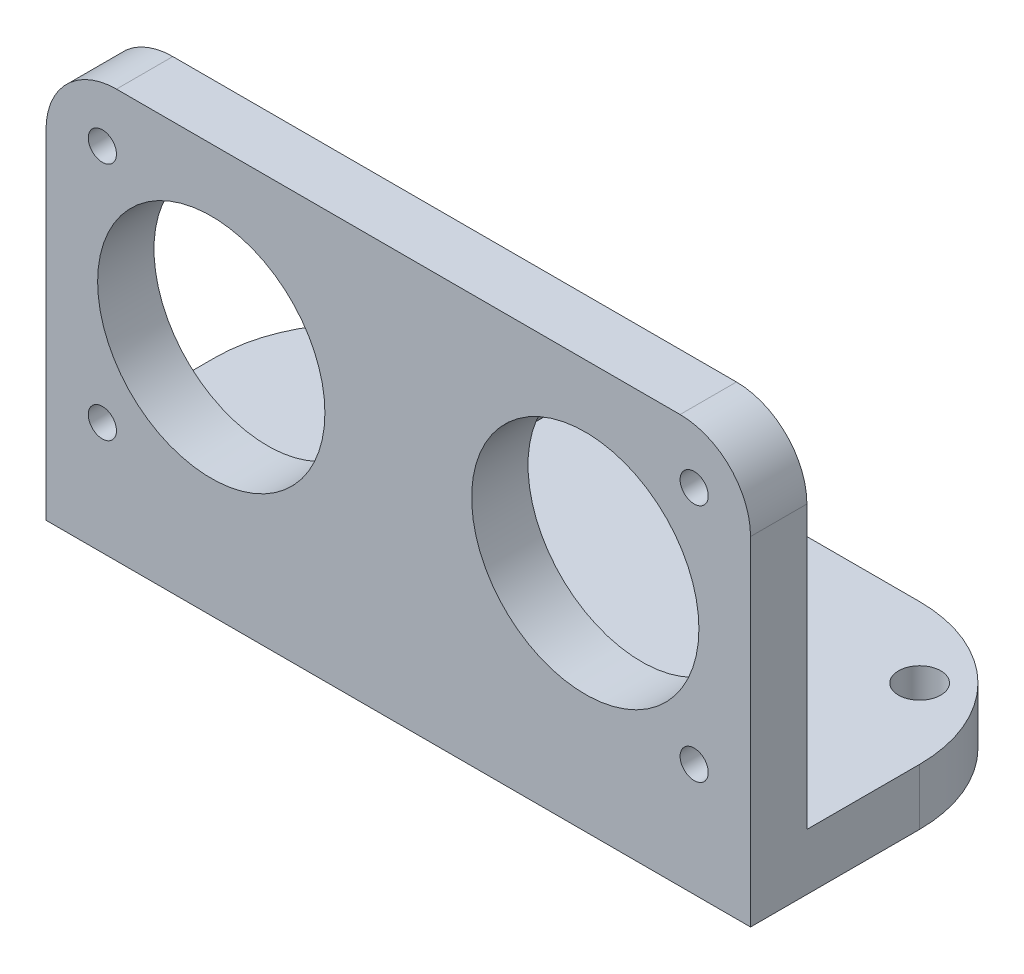
ISO-10303-21;
HEADER;
FILE_DESCRIPTION(('STEP AP214'),'2;1');
FILE_NAME('part.step','',(''),(''),'','','');
FILE_SCHEMA(('AUTOMOTIVE_DESIGN { 1 0 10303 214 1 1 1 1 }'));
ENDSEC;
DATA;
#1=APPLICATION_CONTEXT('core data for automotive mechanical design processes');
#2=APPLICATION_PROTOCOL_DEFINITION('international standard','automotive_design',2000,#1);
#3=PRODUCT_CONTEXT('',#1,'mechanical');
#4=PRODUCT('Part','Part','',(#3));
#5=PRODUCT_RELATED_PRODUCT_CATEGORY('part','',(#4));
#6=PRODUCT_DEFINITION_FORMATION('','',#4);
#7=PRODUCT_DEFINITION_CONTEXT('part definition',#1,'design');
#8=PRODUCT_DEFINITION('design','',#6,#7);
#9=PRODUCT_DEFINITION_SHAPE('','',#8);
#10=(LENGTH_UNIT() NAMED_UNIT(*) SI_UNIT(.MILLI.,.METRE.));
#11=(NAMED_UNIT(*) PLANE_ANGLE_UNIT() SI_UNIT($,.RADIAN.));
#12=(NAMED_UNIT(*) SI_UNIT($,.STERADIAN.) SOLID_ANGLE_UNIT());
#13=UNCERTAINTY_MEASURE_WITH_UNIT(LENGTH_MEASURE(1.E-05),#10,'distance_accuracy_value','');
#14=(GEOMETRIC_REPRESENTATION_CONTEXT(3) GLOBAL_UNCERTAINTY_ASSIGNED_CONTEXT((#13)) GLOBAL_UNIT_ASSIGNED_CONTEXT((#10,
#11,#12)) REPRESENTATION_CONTEXT('',''));
#15=CARTESIAN_POINT('',(0.,0.,0.));
#16=DIRECTION('',(0.,0.,1.));
#17=DIRECTION('',(1.,0.,0.));
#18=AXIS2_PLACEMENT_3D('',#15,#16,#17);
#19=CARTESIAN_POINT('',(0.,0.,0.));
#20=DIRECTION('',(0.,0.,1.));
#21=DIRECTION('',(1.,0.,0.));
#22=AXIS2_PLACEMENT_3D('',#19,#20,#21);
#23=PLANE('',#22);
#24=CARTESIAN_POINT('',(-21.,-8.5,0.));
#25=DIRECTION('',(0.,0.,-1.));
#26=DIRECTION('',(-1.,0.,0.));
#27=AXIS2_PLACEMENT_3D('',#24,#25,#26);
#28=CIRCLE('',#27,0.999999999999994);
#29=CARTESIAN_POINT('',(-22.,-8.5,0.));
#30=VERTEX_POINT('',#29);
#31=EDGE_CURVE('E289',#30,#30,#28,.T.);
#32=ORIENTED_EDGE('',*,*,#31,.F.);
#33=EDGE_LOOP('',(#32));
#34=FACE_BOUND('',#33,.T.);
#35=CARTESIAN_POINT('',(21.,-8.5,0.));
#36=DIRECTION('',(0.,0.,-1.));
#37=DIRECTION('',(-1.,0.,0.));
#38=AXIS2_PLACEMENT_3D('',#35,#36,#37);
#39=CIRCLE('',#38,0.999999999999994);
#40=CARTESIAN_POINT('',(20.,-8.5,0.));
#41=VERTEX_POINT('',#40);
#42=EDGE_CURVE('E283',#41,#41,#39,.T.);
#43=ORIENTED_EDGE('',*,*,#42,.F.);
#44=EDGE_LOOP('',(#43));
#45=FACE_BOUND('',#44,.T.);
#46=CARTESIAN_POINT('',(21.,8.5,0.));
#47=DIRECTION('',(0.,0.,-1.));
#48=DIRECTION('',(-1.,0.,0.));
#49=AXIS2_PLACEMENT_3D('',#46,#47,#48);
#50=CIRCLE('',#49,0.999999999999994);
#51=CARTESIAN_POINT('',(20.,8.5,0.));
#52=VERTEX_POINT('',#51);
#53=EDGE_CURVE('E277',#52,#52,#50,.T.);
#54=ORIENTED_EDGE('',*,*,#53,.F.);
#55=EDGE_LOOP('',(#54));
#56=FACE_BOUND('',#55,.T.);
#57=CARTESIAN_POINT('',(0.,0.,0.));
#58=DIRECTION('',(0.,0.,1.));
#59=DIRECTION('',(1.,0.,0.));
#60=AXIS2_PLACEMENT_3D('',#57,#58,#59);
#61=CIRCLE('',#60,2.);
#62=CARTESIAN_POINT('',(2.,0.,0.));
#63=VERTEX_POINT('',#62);
#64=EDGE_CURVE('E151',#63,#63,#61,.F.);
#65=ORIENTED_EDGE('',*,*,#64,.F.);
#66=EDGE_LOOP('',(#65));
#67=FACE_BOUND('',#66,.T.);
#68=CARTESIAN_POINT('',(-13.2715,0.,0.));
#69=DIRECTION('',(0.,0.,1.));
#70=DIRECTION('',(1.,0.,0.));
#71=AXIS2_PLACEMENT_3D('',#68,#69,#70);
#72=CIRCLE('',#71,8.0645);
#73=CARTESIAN_POINT('',(-5.207,0.,0.));
#74=VERTEX_POINT('',#73);
#75=EDGE_CURVE('E162',#74,#74,#72,.F.);
#76=ORIENTED_EDGE('',*,*,#75,.F.);
#77=EDGE_LOOP('',(#76));
#78=FACE_BOUND('',#77,.T.);
#79=CARTESIAN_POINT('',(13.2715,0.,0.));
#80=DIRECTION('',(0.,0.,1.));
#81=DIRECTION('',(1.,0.,0.));
#82=AXIS2_PLACEMENT_3D('',#79,#80,#81);
#83=CIRCLE('',#82,8.0645);
#84=CARTESIAN_POINT('',(21.336,0.,0.));
#85=VERTEX_POINT('',#84);
#86=EDGE_CURVE('E144',#85,#85,#83,.T.);
#87=ORIENTED_EDGE('',*,*,#86,.T.);
#88=EDGE_LOOP('',(#87));
#89=FACE_BOUND('',#88,.T.);
#90=DIRECTION('',(-1.,0.,0.));
#91=VECTOR('',#90,1.);
#92=CARTESIAN_POINT('',(-25.,12.5,0.));
#93=LINE('',#92,#91);
#94=CARTESIAN_POINT('',(20.,12.5,0.));
#95=VERTEX_POINT('',#94);
#96=CARTESIAN_POINT('',(-20.,12.5,0.));
#97=VERTEX_POINT('',#96);
#98=EDGE_CURVE('E136',#95,#97,#93,.T.);
#99=ORIENTED_EDGE('',*,*,#98,.F.);
#100=CARTESIAN_POINT('',(20.,7.5,0.));
#101=DIRECTION('',(0.,0.,1.));
#102=DIRECTION('',(1.,0.,0.));
#103=AXIS2_PLACEMENT_3D('',#100,#101,#102);
#104=CIRCLE('',#103,5.);
#105=CARTESIAN_POINT('',(25.,7.5,0.));
#106=VERTEX_POINT('',#105);
#107=EDGE_CURVE('E191',#95,#106,#104,.F.);
#108=ORIENTED_EDGE('',*,*,#107,.T.);
#109=DIRECTION('',(0.,1.,0.));
#110=VECTOR('',#109,1.);
#111=CARTESIAN_POINT('',(25.,12.5,0.));
#112=LINE('',#111,#110);
#113=CARTESIAN_POINT('',(25.,-12.5,0.));
#114=VERTEX_POINT('',#113);
#115=EDGE_CURVE('E134',#114,#106,#112,.T.);
#116=ORIENTED_EDGE('',*,*,#115,.F.);
#117=DIRECTION('',(1.,0.,0.));
#118=VECTOR('',#117,1.);
#119=CARTESIAN_POINT('',(-25.,-12.5,0.));
#120=LINE('',#119,#118);
#121=CARTESIAN_POINT('',(-25.,-12.5,0.));
#122=VERTEX_POINT('',#121);
#123=EDGE_CURVE('E130',#122,#114,#120,.T.);
#124=ORIENTED_EDGE('',*,*,#123,.F.);
#125=DIRECTION('',(0.,-1.,0.));
#126=VECTOR('',#125,1.);
#127=CARTESIAN_POINT('',(-25.,12.5,0.));
#128=LINE('',#127,#126);
#129=CARTESIAN_POINT('',(-25.,7.5,0.));
#130=VERTEX_POINT('',#129);
#131=EDGE_CURVE('E155',#130,#122,#128,.T.);
#132=ORIENTED_EDGE('',*,*,#131,.F.);
#133=CARTESIAN_POINT('',(-20.,7.5,0.));
#134=DIRECTION('',(0.,0.,1.));
#135=DIRECTION('',(1.,0.,0.));
#136=AXIS2_PLACEMENT_3D('',#133,#134,#135);
#137=CIRCLE('',#136,5.);
#138=EDGE_CURVE('E189',#130,#97,#137,.F.);
#139=ORIENTED_EDGE('',*,*,#138,.T.);
#140=EDGE_LOOP('',(#99,#108,#116,#124,#132,#139));
#141=FACE_BOUND('',#140,.T.);
#142=CARTESIAN_POINT('',(-21.,8.5,0.));
#143=DIRECTION('',(0.,0.,-1.));
#144=DIRECTION('',(-1.,0.,0.));
#145=AXIS2_PLACEMENT_3D('',#142,#143,#144);
#146=CIRCLE('',#145,0.999999999999994);
#147=CARTESIAN_POINT('',(-22.,8.5,0.));
#148=VERTEX_POINT('',#147);
#149=EDGE_CURVE('E295',#148,#148,#146,.T.);
#150=ORIENTED_EDGE('',*,*,#149,.F.);
#151=EDGE_LOOP('',(#150));
#152=FACE_BOUND('',#151,.T.);
#153=ADVANCED_FACE('F33',(#34,#45,#56,#67,#78,#89,#141,#152),#23,.F.);
#154=CARTESIAN_POINT('',(25.,12.5,4.));
#155=DIRECTION('',(-1.,0.,0.));
#156=DIRECTION('',(0.,-1.,0.));
#157=AXIS2_PLACEMENT_3D('',#154,#155,#156);
#158=PLANE('',#157);
#159=ORIENTED_EDGE('',*,*,#115,.T.);
#160=DIRECTION('',(0.,0.,-1.));
#161=VECTOR('',#160,1.);
#162=CARTESIAN_POINT('',(25.,7.5,4.));
#163=LINE('',#162,#161);
#164=CARTESIAN_POINT('',(25.,7.5,4.));
#165=VERTEX_POINT('',#164);
#166=EDGE_CURVE('E56',#106,#165,#163,.F.);
#167=ORIENTED_EDGE('',*,*,#166,.T.);
#168=DIRECTION('',(0.,1.,0.));
#169=VECTOR('',#168,1.);
#170=CARTESIAN_POINT('',(25.,12.5,4.));
#171=LINE('',#170,#169);
#172=CARTESIAN_POINT('',(25.,-16.5,4.));
#173=VERTEX_POINT('',#172);
#174=EDGE_CURVE('E126',#173,#165,#171,.T.);
#175=ORIENTED_EDGE('',*,*,#174,.F.);
#176=DIRECTION('',(0.,0.,1.));
#177=VECTOR('',#176,1.);
#178=CARTESIAN_POINT('',(25.,-16.5,-18.));
#179=LINE('',#178,#177);
#180=CARTESIAN_POINT('',(25.,-16.5,-7.99999999999999));
#181=VERTEX_POINT('',#180);
#182=EDGE_CURVE('E113',#181,#173,#179,.T.);
#183=ORIENTED_EDGE('',*,*,#182,.F.);
#184=DIRECTION('',(0.,1.,0.));
#185=VECTOR('',#184,1.);
#186=CARTESIAN_POINT('',(25.,12.5,-7.99999999999999));
#187=LINE('',#186,#185);
#188=CARTESIAN_POINT('',(25.,-12.5,-7.99999999999999));
#189=VERTEX_POINT('',#188);
#190=EDGE_CURVE('E168',#181,#189,#187,.T.);
#191=ORIENTED_EDGE('',*,*,#190,.T.);
#192=DIRECTION('',(0.,0.,1.));
#193=VECTOR('',#192,1.);
#194=CARTESIAN_POINT('',(25.,-12.5,-18.));
#195=LINE('',#194,#193);
#196=EDGE_CURVE('E147',#189,#114,#195,.T.);
#197=ORIENTED_EDGE('',*,*,#196,.T.);
#198=EDGE_LOOP('',(#159,#167,#175,#183,#191,#197));
#199=FACE_BOUND('',#198,.T.);
#200=ADVANCED_FACE('F127',(#199),#158,.F.);
#201=CARTESIAN_POINT('',(-25.,12.5,4.));
#202=DIRECTION('',(0.,-1.,0.));
#203=DIRECTION('',(0.,0.,-1.));
#204=AXIS2_PLACEMENT_3D('',#201,#202,#203);
#205=PLANE('',#204);
#206=DIRECTION('',(-1.,0.,0.));
#207=VECTOR('',#206,1.);
#208=CARTESIAN_POINT('',(-25.,12.5,4.));
#209=LINE('',#208,#207);
#210=CARTESIAN_POINT('',(20.,12.5,4.));
#211=VERTEX_POINT('',#210);
#212=CARTESIAN_POINT('',(-20.,12.5,4.));
#213=VERTEX_POINT('',#212);
#214=EDGE_CURVE('E129',#211,#213,#209,.T.);
#215=ORIENTED_EDGE('',*,*,#214,.F.);
#216=DIRECTION('',(0.,0.,-1.));
#217=VECTOR('',#216,1.);
#218=CARTESIAN_POINT('',(20.,12.5,4.));
#219=LINE('',#218,#217);
#220=EDGE_CURVE('E186',#211,#95,#219,.T.);
#221=ORIENTED_EDGE('',*,*,#220,.T.);
#222=ORIENTED_EDGE('',*,*,#98,.T.);
#223=DIRECTION('',(0.,0.,-1.));
#224=VECTOR('',#223,1.);
#225=CARTESIAN_POINT('',(-20.,12.5,4.));
#226=LINE('',#225,#224);
#227=EDGE_CURVE('E184',#97,#213,#226,.F.);
#228=ORIENTED_EDGE('',*,*,#227,.T.);
#229=EDGE_LOOP('',(#215,#221,#222,#228));
#230=FACE_BOUND('',#229,.T.);
#231=ADVANCED_FACE('F198',(#230),#205,.F.);
#232=CARTESIAN_POINT('',(-25.,12.5,4.));
#233=DIRECTION('',(1.,0.,0.));
#234=DIRECTION('',(0.,1.,0.));
#235=AXIS2_PLACEMENT_3D('',#232,#233,#234);
#236=PLANE('',#235);
#237=DIRECTION('',(0.,-1.,0.));
#238=VECTOR('',#237,1.);
#239=CARTESIAN_POINT('',(-25.,12.5,4.));
#240=LINE('',#239,#238);
#241=CARTESIAN_POINT('',(-25.,7.5,4.));
#242=VERTEX_POINT('',#241);
#243=CARTESIAN_POINT('',(-25.,-16.5,4.));
#244=VERTEX_POINT('',#243);
#245=EDGE_CURVE('E133',#242,#244,#240,.T.);
#246=ORIENTED_EDGE('',*,*,#245,.F.);
#247=DIRECTION('',(0.,0.,-1.));
#248=VECTOR('',#247,1.);
#249=CARTESIAN_POINT('',(-25.,7.5,4.));
#250=LINE('',#249,#248);
#251=EDGE_CURVE('E11',#242,#130,#250,.T.);
#252=ORIENTED_EDGE('',*,*,#251,.T.);
#253=ORIENTED_EDGE('',*,*,#131,.T.);
#254=DIRECTION('',(0.,0.,-1.));
#255=VECTOR('',#254,1.);
#256=CARTESIAN_POINT('',(-25.,-12.5,-18.));
#257=LINE('',#256,#255);
#258=CARTESIAN_POINT('',(-25.,-12.5,-8.));
#259=VERTEX_POINT('',#258);
#260=EDGE_CURVE('E140',#122,#259,#257,.T.);
#261=ORIENTED_EDGE('',*,*,#260,.T.);
#262=DIRECTION('',(0.,1.,0.));
#263=VECTOR('',#262,1.);
#264=CARTESIAN_POINT('',(-25.,12.5,-8.));
#265=LINE('',#264,#263);
#266=CARTESIAN_POINT('',(-25.,-16.5,-8.));
#267=VERTEX_POINT('',#266);
#268=EDGE_CURVE('E182',#259,#267,#265,.F.);
#269=ORIENTED_EDGE('',*,*,#268,.T.);
#270=DIRECTION('',(0.,0.,-1.));
#271=VECTOR('',#270,1.);
#272=CARTESIAN_POINT('',(-25.,-16.5,-18.));
#273=LINE('',#272,#271);
#274=EDGE_CURVE('E148',#244,#267,#273,.T.);
#275=ORIENTED_EDGE('',*,*,#274,.F.);
#276=EDGE_LOOP('',(#246,#252,#253,#261,#269,#275));
#277=FACE_BOUND('',#276,.T.);
#278=ADVANCED_FACE('F213',(#277),#236,.F.);
#279=CARTESIAN_POINT('',(0.,0.,4.));
#280=DIRECTION('',(0.,0.,1.));
#281=DIRECTION('',(1.,0.,0.));
#282=AXIS2_PLACEMENT_3D('',#279,#280,#281);
#283=PLANE('',#282);
#284=CARTESIAN_POINT('',(-21.,8.5,4.));
#285=DIRECTION('',(0.,0.,-1.));
#286=DIRECTION('',(-1.,0.,0.));
#287=AXIS2_PLACEMENT_3D('',#284,#285,#286);
#288=CIRCLE('',#287,0.999999999999994);
#289=CARTESIAN_POINT('',(-22.,8.5,4.));
#290=VERTEX_POINT('',#289);
#291=EDGE_CURVE('E292',#290,#290,#288,.T.);
#292=ORIENTED_EDGE('',*,*,#291,.T.);
#293=EDGE_LOOP('',(#292));
#294=FACE_BOUND('',#293,.T.);
#295=CARTESIAN_POINT('',(-21.,-8.5,4.));
#296=DIRECTION('',(0.,0.,-1.));
#297=DIRECTION('',(-1.,0.,0.));
#298=AXIS2_PLACEMENT_3D('',#295,#296,#297);
#299=CIRCLE('',#298,0.999999999999994);
#300=CARTESIAN_POINT('',(-22.,-8.5,4.));
#301=VERTEX_POINT('',#300);
#302=EDGE_CURVE('E286',#301,#301,#299,.T.);
#303=ORIENTED_EDGE('',*,*,#302,.T.);
#304=EDGE_LOOP('',(#303));
#305=FACE_BOUND('',#304,.T.);
#306=CARTESIAN_POINT('',(21.,-8.5,4.));
#307=DIRECTION('',(0.,0.,-1.));
#308=DIRECTION('',(-1.,0.,0.));
#309=AXIS2_PLACEMENT_3D('',#306,#307,#308);
#310=CIRCLE('',#309,0.999999999999994);
#311=CARTESIAN_POINT('',(20.,-8.5,4.));
#312=VERTEX_POINT('',#311);
#313=EDGE_CURVE('E280',#312,#312,#310,.T.);
#314=ORIENTED_EDGE('',*,*,#313,.T.);
#315=EDGE_LOOP('',(#314));
#316=FACE_BOUND('',#315,.T.);
#317=CARTESIAN_POINT('',(21.,8.5,4.));
#318=DIRECTION('',(0.,0.,-1.));
#319=DIRECTION('',(-1.,0.,0.));
#320=AXIS2_PLACEMENT_3D('',#317,#318,#319);
#321=CIRCLE('',#320,0.999999999999994);
#322=CARTESIAN_POINT('',(20.,8.5,4.));
#323=VERTEX_POINT('',#322);
#324=EDGE_CURVE('E274',#323,#323,#321,.T.);
#325=ORIENTED_EDGE('',*,*,#324,.T.);
#326=EDGE_LOOP('',(#325));
#327=FACE_BOUND('',#326,.T.);
#328=CARTESIAN_POINT('',(-13.2715,0.,4.));
#329=DIRECTION('',(0.,0.,-1.));
#330=DIRECTION('',(-1.,0.,0.));
#331=AXIS2_PLACEMENT_3D('',#328,#329,#330);
#332=CIRCLE('',#331,8.0645);
#333=CARTESIAN_POINT('',(-21.336,0.,4.));
#334=VERTEX_POINT('',#333);
#335=EDGE_CURVE('E165',#334,#334,#332,.T.);
#336=ORIENTED_EDGE('',*,*,#335,.T.);
#337=EDGE_LOOP('',(#336));
#338=FACE_BOUND('',#337,.T.);
#339=CARTESIAN_POINT('',(13.2715,0.,4.));
#340=DIRECTION('',(0.,0.,1.));
#341=DIRECTION('',(1.,0.,0.));
#342=AXIS2_PLACEMENT_3D('',#339,#340,#341);
#343=CIRCLE('',#342,8.0645);
#344=CARTESIAN_POINT('',(21.336,0.,4.));
#345=VERTEX_POINT('',#344);
#346=EDGE_CURVE('E161',#345,#345,#343,.T.);
#347=ORIENTED_EDGE('',*,*,#346,.F.);
#348=EDGE_LOOP('',(#347));
#349=FACE_BOUND('',#348,.T.);
#350=ORIENTED_EDGE('',*,*,#174,.T.);
#351=CARTESIAN_POINT('',(20.,7.5,4.));
#352=DIRECTION('',(0.,0.,1.));
#353=DIRECTION('',(1.,0.,0.));
#354=AXIS2_PLACEMENT_3D('',#351,#352,#353);
#355=CIRCLE('',#354,5.);
#356=EDGE_CURVE('E41',#165,#211,#355,.T.);
#357=ORIENTED_EDGE('',*,*,#356,.T.);
#358=ORIENTED_EDGE('',*,*,#214,.T.);
#359=CARTESIAN_POINT('',(-20.,7.5,4.));
#360=DIRECTION('',(0.,0.,1.));
#361=DIRECTION('',(1.,0.,0.));
#362=AXIS2_PLACEMENT_3D('',#359,#360,#361);
#363=CIRCLE('',#362,5.);
#364=EDGE_CURVE('E48',#213,#242,#363,.T.);
#365=ORIENTED_EDGE('',*,*,#364,.T.);
#366=ORIENTED_EDGE('',*,*,#245,.T.);
#367=DIRECTION('',(-1.,0.,0.));
#368=VECTOR('',#367,1.);
#369=CARTESIAN_POINT('',(25.,-16.5,4.));
#370=LINE('',#369,#368);
#371=EDGE_CURVE('E118',#173,#244,#370,.T.);
#372=ORIENTED_EDGE('',*,*,#371,.F.);
#373=EDGE_LOOP('',(#350,#357,#358,#365,#366,#372));
#374=FACE_BOUND('',#373,.T.);
#375=ADVANCED_FACE('F132',(#294,#305,#316,#327,#338,#349,#374),#283,.T.);
#376=CARTESIAN_POINT('',(0.,-12.5,0.));
#377=DIRECTION('',(0.,-1.,0.));
#378=DIRECTION('',(0.,0.,-1.));
#379=AXIS2_PLACEMENT_3D('',#376,#377,#378);
#380=PLANE('',#379);
#381=CARTESIAN_POINT('',(20.,-12.5,-13.));
#382=DIRECTION('',(0.,1.,0.));
#383=DIRECTION('',(0.,0.,1.));
#384=AXIS2_PLACEMENT_3D('',#381,#382,#383);
#385=CIRCLE('',#384,1.49999999999999);
#386=CARTESIAN_POINT('',(20.,-12.5,-11.5));
#387=VERTEX_POINT('',#386);
#388=EDGE_CURVE('E271',#387,#387,#385,.T.);
#389=ORIENTED_EDGE('',*,*,#388,.F.);
#390=EDGE_LOOP('',(#389));
#391=FACE_BOUND('',#390,.T.);
#392=CARTESIAN_POINT('',(-20.,-12.5,-13.));
#393=DIRECTION('',(0.,1.,0.));
#394=DIRECTION('',(0.,0.,1.));
#395=AXIS2_PLACEMENT_3D('',#392,#393,#394);
#396=CIRCLE('',#395,1.49999999999999);
#397=CARTESIAN_POINT('',(-20.,-12.5,-11.5));
#398=VERTEX_POINT('',#397);
#399=EDGE_CURVE('E265',#398,#398,#396,.T.);
#400=ORIENTED_EDGE('',*,*,#399,.F.);
#401=EDGE_LOOP('',(#400));
#402=FACE_BOUND('',#401,.T.);
#403=ORIENTED_EDGE('',*,*,#196,.F.);
#404=CARTESIAN_POINT('',(15.,-12.5,-7.99999999999999));
#405=DIRECTION('',(0.,-1.,0.));
#406=DIRECTION('',(0.,0.,-1.));
#407=AXIS2_PLACEMENT_3D('',#404,#405,#406);
#408=CIRCLE('',#407,10.);
#409=CARTESIAN_POINT('',(15.,-12.5,-18.));
#410=VERTEX_POINT('',#409);
#411=EDGE_CURVE('E172',#189,#410,#408,.F.);
#412=ORIENTED_EDGE('',*,*,#411,.T.);
#413=DIRECTION('',(1.,0.,0.));
#414=VECTOR('',#413,1.);
#415=CARTESIAN_POINT('',(25.,-12.5,-18.));
#416=LINE('',#415,#414);
#417=CARTESIAN_POINT('',(-15.,-12.5,-18.));
#418=VERTEX_POINT('',#417);
#419=EDGE_CURVE('E143',#418,#410,#416,.T.);
#420=ORIENTED_EDGE('',*,*,#419,.F.);
#421=CARTESIAN_POINT('',(-15.,-12.5,-8.));
#422=DIRECTION('',(0.,-1.,0.));
#423=DIRECTION('',(0.,0.,-1.));
#424=AXIS2_PLACEMENT_3D('',#421,#422,#423);
#425=CIRCLE('',#424,10.);
#426=EDGE_CURVE('E170',#418,#259,#425,.F.);
#427=ORIENTED_EDGE('',*,*,#426,.T.);
#428=ORIENTED_EDGE('',*,*,#260,.F.);
#429=ORIENTED_EDGE('',*,*,#123,.T.);
#430=EDGE_LOOP('',(#403,#412,#420,#427,#428,#429));
#431=FACE_BOUND('',#430,.T.);
#432=ADVANCED_FACE('F208',(#391,#402,#431),#380,.F.);
#433=CARTESIAN_POINT('',(25.,-16.5,-18.));
#434=DIRECTION('',(0.,0.,1.));
#435=DIRECTION('',(1.,0.,0.));
#436=AXIS2_PLACEMENT_3D('',#433,#434,#435);
#437=PLANE('',#436);
#438=ORIENTED_EDGE('',*,*,#419,.T.);
#439=DIRECTION('',(0.,1.,0.));
#440=VECTOR('',#439,1.);
#441=CARTESIAN_POINT('',(15.,-16.5,-18.));
#442=LINE('',#441,#440);
#443=CARTESIAN_POINT('',(15.,-16.5,-18.));
#444=VERTEX_POINT('',#443);
#445=EDGE_CURVE('E177',#410,#444,#442,.F.);
#446=ORIENTED_EDGE('',*,*,#445,.T.);
#447=DIRECTION('',(1.,0.,0.));
#448=VECTOR('',#447,1.);
#449=CARTESIAN_POINT('',(25.,-16.5,-18.));
#450=LINE('',#449,#448);
#451=CARTESIAN_POINT('',(-15.,-16.5,-18.));
#452=VERTEX_POINT('',#451);
#453=EDGE_CURVE('E124',#452,#444,#450,.T.);
#454=ORIENTED_EDGE('',*,*,#453,.F.);
#455=DIRECTION('',(0.,1.,0.));
#456=VECTOR('',#455,1.);
#457=CARTESIAN_POINT('',(-15.,-16.5,-18.));
#458=LINE('',#457,#456);
#459=EDGE_CURVE('E174',#452,#418,#458,.T.);
#460=ORIENTED_EDGE('',*,*,#459,.T.);
#461=EDGE_LOOP('',(#438,#446,#454,#460));
#462=FACE_BOUND('',#461,.T.);
#463=ADVANCED_FACE('F251',(#462),#437,.F.);
#464=CARTESIAN_POINT('',(0.,-16.5,0.));
#465=DIRECTION('',(0.,-1.,0.));
#466=DIRECTION('',(0.,0.,-1.));
#467=AXIS2_PLACEMENT_3D('',#464,#465,#466);
#468=PLANE('',#467);
#469=CARTESIAN_POINT('',(20.,-16.5,-13.));
#470=DIRECTION('',(0.,1.,0.));
#471=DIRECTION('',(0.,0.,1.));
#472=AXIS2_PLACEMENT_3D('',#469,#470,#471);
#473=CIRCLE('',#472,1.49999999999999);
#474=CARTESIAN_POINT('',(20.,-16.5,-11.5));
#475=VERTEX_POINT('',#474);
#476=EDGE_CURVE('E268',#475,#475,#473,.T.);
#477=ORIENTED_EDGE('',*,*,#476,.T.);
#478=EDGE_LOOP('',(#477));
#479=FACE_BOUND('',#478,.T.);
#480=CARTESIAN_POINT('',(-20.,-16.5,-13.));
#481=DIRECTION('',(0.,1.,0.));
#482=DIRECTION('',(0.,0.,1.));
#483=AXIS2_PLACEMENT_3D('',#480,#481,#482);
#484=CIRCLE('',#483,1.49999999999999);
#485=CARTESIAN_POINT('',(-20.,-16.5,-11.5));
#486=VERTEX_POINT('',#485);
#487=EDGE_CURVE('E262',#486,#486,#484,.T.);
#488=ORIENTED_EDGE('',*,*,#487,.T.);
#489=EDGE_LOOP('',(#488));
#490=FACE_BOUND('',#489,.T.);
#491=ORIENTED_EDGE('',*,*,#453,.T.);
#492=CARTESIAN_POINT('',(15.,-16.5,-7.99999999999999));
#493=DIRECTION('',(0.,-1.,0.));
#494=DIRECTION('',(0.,0.,-1.));
#495=AXIS2_PLACEMENT_3D('',#492,#493,#494);
#496=CIRCLE('',#495,10.);
#497=EDGE_CURVE('E121',#444,#181,#496,.T.);
#498=ORIENTED_EDGE('',*,*,#497,.T.);
#499=ORIENTED_EDGE('',*,*,#182,.T.);
#500=ORIENTED_EDGE('',*,*,#371,.T.);
#501=ORIENTED_EDGE('',*,*,#274,.T.);
#502=CARTESIAN_POINT('',(-15.,-16.5,-8.));
#503=DIRECTION('',(0.,-1.,0.));
#504=DIRECTION('',(0.,0.,-1.));
#505=AXIS2_PLACEMENT_3D('',#502,#503,#504);
#506=CIRCLE('',#505,10.);
#507=EDGE_CURVE('E179',#267,#452,#506,.T.);
#508=ORIENTED_EDGE('',*,*,#507,.T.);
#509=EDGE_LOOP('',(#491,#498,#499,#500,#501,#508));
#510=FACE_BOUND('',#509,.T.);
#511=ADVANCED_FACE('F115',(#479,#490,#510),#468,.T.);
#512=CARTESIAN_POINT('',(13.2715,0.,-18.));
#513=DIRECTION('',(0.,0.,1.));
#514=DIRECTION('',(1.,0.,0.));
#515=AXIS2_PLACEMENT_3D('',#512,#513,#514);
#516=CYLINDRICAL_SURFACE('',#515,8.0645);
#517=ORIENTED_EDGE('',*,*,#346,.T.);
#518=EDGE_LOOP('',(#517));
#519=FACE_BOUND('',#518,.T.);
#520=ORIENTED_EDGE('',*,*,#86,.F.);
#521=EDGE_LOOP('',(#520));
#522=FACE_BOUND('',#521,.T.);
#523=ADVANCED_FACE('F337',(#519,#522),#516,.F.);
#524=CARTESIAN_POINT('',(-13.2715,0.,-18.));
#525=DIRECTION('',(0.,0.,1.));
#526=DIRECTION('',(1.,0.,0.));
#527=AXIS2_PLACEMENT_3D('',#524,#525,#526);
#528=CYLINDRICAL_SURFACE('',#527,8.0645);
#529=ORIENTED_EDGE('',*,*,#335,.F.);
#530=EDGE_LOOP('',(#529));
#531=FACE_BOUND('',#530,.T.);
#532=ORIENTED_EDGE('',*,*,#75,.T.);
#533=EDGE_LOOP('',(#532));
#534=FACE_BOUND('',#533,.T.);
#535=ADVANCED_FACE('F333',(#531,#534),#528,.F.);
#536=CARTESIAN_POINT('',(0.,0.,-5.));
#537=DIRECTION('',(0.,0.,1.));
#538=DIRECTION('',(1.,0.,0.));
#539=AXIS2_PLACEMENT_3D('',#536,#537,#538);
#540=CYLINDRICAL_SURFACE('',#539,2.);
#541=CARTESIAN_POINT('',(0.,0.,-5.));
#542=DIRECTION('',(0.,0.,-1.));
#543=DIRECTION('',(-1.,0.,0.));
#544=AXIS2_PLACEMENT_3D('',#541,#542,#543);
#545=CIRCLE('',#544,2.);
#546=CARTESIAN_POINT('',(-2.,0.,-5.));
#547=VERTEX_POINT('',#546);
#548=EDGE_CURVE('E259',#547,#547,#545,.T.);
#549=ORIENTED_EDGE('',*,*,#548,.F.);
#550=EDGE_LOOP('',(#549));
#551=FACE_BOUND('',#550,.T.);
#552=ORIENTED_EDGE('',*,*,#64,.T.);
#553=EDGE_LOOP('',(#552));
#554=FACE_BOUND('',#553,.T.);
#555=ADVANCED_FACE('F329',(#551,#554),#540,.T.);
#556=CARTESIAN_POINT('',(0.,0.,-5.));
#557=DIRECTION('',(0.,0.,-1.));
#558=DIRECTION('',(-1.,0.,0.));
#559=AXIS2_PLACEMENT_3D('',#556,#557,#558);
#560=PLANE('',#559);
#561=ORIENTED_EDGE('',*,*,#548,.T.);
#562=EDGE_LOOP('',(#561));
#563=FACE_BOUND('',#562,.T.);
#564=ADVANCED_FACE('F325',(#563),#560,.T.);
#565=CARTESIAN_POINT('',(-20.,-12.5,-13.));
#566=DIRECTION('',(0.,1.,0.));
#567=DIRECTION('',(0.,0.,1.));
#568=AXIS2_PLACEMENT_3D('',#565,#566,#567);
#569=CYLINDRICAL_SURFACE('',#568,1.49999999999999);
#570=ORIENTED_EDGE('',*,*,#487,.F.);
#571=EDGE_LOOP('',(#570));
#572=FACE_BOUND('',#571,.T.);
#573=ORIENTED_EDGE('',*,*,#399,.T.);
#574=EDGE_LOOP('',(#573));
#575=FACE_BOUND('',#574,.T.);
#576=ADVANCED_FACE('F321',(#572,#575),#569,.F.);
#577=CARTESIAN_POINT('',(20.,-12.5,-13.));
#578=DIRECTION('',(0.,1.,0.));
#579=DIRECTION('',(0.,0.,1.));
#580=AXIS2_PLACEMENT_3D('',#577,#578,#579);
#581=CYLINDRICAL_SURFACE('',#580,1.49999999999999);
#582=ORIENTED_EDGE('',*,*,#476,.F.);
#583=EDGE_LOOP('',(#582));
#584=FACE_BOUND('',#583,.T.);
#585=ORIENTED_EDGE('',*,*,#388,.T.);
#586=EDGE_LOOP('',(#585));
#587=FACE_BOUND('',#586,.T.);
#588=ADVANCED_FACE('F317',(#584,#587),#581,.F.);
#589=CARTESIAN_POINT('',(21.,8.5,0.));
#590=DIRECTION('',(0.,0.,-1.));
#591=DIRECTION('',(-1.,0.,0.));
#592=AXIS2_PLACEMENT_3D('',#589,#590,#591);
#593=CYLINDRICAL_SURFACE('',#592,0.999999999999994);
#594=ORIENTED_EDGE('',*,*,#324,.F.);
#595=EDGE_LOOP('',(#594));
#596=FACE_BOUND('',#595,.T.);
#597=ORIENTED_EDGE('',*,*,#53,.T.);
#598=EDGE_LOOP('',(#597));
#599=FACE_BOUND('',#598,.T.);
#600=ADVANCED_FACE('F313',(#596,#599),#593,.F.);
#601=CARTESIAN_POINT('',(21.,-8.5,0.));
#602=DIRECTION('',(0.,0.,-1.));
#603=DIRECTION('',(-1.,0.,0.));
#604=AXIS2_PLACEMENT_3D('',#601,#602,#603);
#605=CYLINDRICAL_SURFACE('',#604,0.999999999999994);
#606=ORIENTED_EDGE('',*,*,#313,.F.);
#607=EDGE_LOOP('',(#606));
#608=FACE_BOUND('',#607,.T.);
#609=ORIENTED_EDGE('',*,*,#42,.T.);
#610=EDGE_LOOP('',(#609));
#611=FACE_BOUND('',#610,.T.);
#612=ADVANCED_FACE('F306',(#608,#611),#605,.F.);
#613=CARTESIAN_POINT('',(-21.,-8.5,0.));
#614=DIRECTION('',(0.,0.,-1.));
#615=DIRECTION('',(-1.,0.,0.));
#616=AXIS2_PLACEMENT_3D('',#613,#614,#615);
#617=CYLINDRICAL_SURFACE('',#616,0.999999999999994);
#618=ORIENTED_EDGE('',*,*,#302,.F.);
#619=EDGE_LOOP('',(#618));
#620=FACE_BOUND('',#619,.T.);
#621=ORIENTED_EDGE('',*,*,#31,.T.);
#622=EDGE_LOOP('',(#621));
#623=FACE_BOUND('',#622,.T.);
#624=ADVANCED_FACE('F300',(#620,#623),#617,.F.);
#625=CARTESIAN_POINT('',(-21.,8.5,0.));
#626=DIRECTION('',(0.,0.,-1.));
#627=DIRECTION('',(-1.,0.,0.));
#628=AXIS2_PLACEMENT_3D('',#625,#626,#627);
#629=CYLINDRICAL_SURFACE('',#628,0.999999999999994);
#630=ORIENTED_EDGE('',*,*,#291,.F.);
#631=EDGE_LOOP('',(#630));
#632=FACE_BOUND('',#631,.T.);
#633=ORIENTED_EDGE('',*,*,#149,.T.);
#634=EDGE_LOOP('',(#633));
#635=FACE_BOUND('',#634,.T.);
#636=ADVANCED_FACE('F241',(#632,#635),#629,.F.);
#637=CARTESIAN_POINT('',(15.,12.5,-7.99999999999999));
#638=DIRECTION('',(0.,1.,0.));
#639=DIRECTION('',(-1.,0.,0.));
#640=AXIS2_PLACEMENT_3D('',#637,#638,#639);
#641=CYLINDRICAL_SURFACE('',#640,10.);
#642=ORIENTED_EDGE('',*,*,#497,.F.);
#643=ORIENTED_EDGE('',*,*,#445,.F.);
#644=ORIENTED_EDGE('',*,*,#411,.F.);
#645=ORIENTED_EDGE('',*,*,#190,.F.);
#646=EDGE_LOOP('',(#642,#643,#644,#645));
#647=FACE_BOUND('',#646,.T.);
#648=ADVANCED_FACE('F238',(#647),#641,.T.);
#649=CARTESIAN_POINT('',(-15.,-16.5,-8.));
#650=DIRECTION('',(0.,1.,0.));
#651=DIRECTION('',(-1.,0.,0.));
#652=AXIS2_PLACEMENT_3D('',#649,#650,#651);
#653=CYLINDRICAL_SURFACE('',#652,10.);
#654=ORIENTED_EDGE('',*,*,#507,.F.);
#655=ORIENTED_EDGE('',*,*,#268,.F.);
#656=ORIENTED_EDGE('',*,*,#426,.F.);
#657=ORIENTED_EDGE('',*,*,#459,.F.);
#658=EDGE_LOOP('',(#654,#655,#656,#657));
#659=FACE_BOUND('',#658,.T.);
#660=ADVANCED_FACE('F221',(#659),#653,.T.);
#661=CARTESIAN_POINT('',(20.,7.5,4.));
#662=DIRECTION('',(0.,0.,-1.));
#663=DIRECTION('',(-1.,0.,0.));
#664=AXIS2_PLACEMENT_3D('',#661,#662,#663);
#665=CYLINDRICAL_SURFACE('',#664,5.);
#666=ORIENTED_EDGE('',*,*,#356,.F.);
#667=ORIENTED_EDGE('',*,*,#166,.F.);
#668=ORIENTED_EDGE('',*,*,#107,.F.);
#669=ORIENTED_EDGE('',*,*,#220,.F.);
#670=EDGE_LOOP('',(#666,#667,#668,#669));
#671=FACE_BOUND('',#670,.T.);
#672=ADVANCED_FACE('F201',(#671),#665,.T.);
#673=CARTESIAN_POINT('',(-20.,7.5,4.));
#674=DIRECTION('',(0.,0.,-1.));
#675=DIRECTION('',(-1.,0.,0.));
#676=AXIS2_PLACEMENT_3D('',#673,#674,#675);
#677=CYLINDRICAL_SURFACE('',#676,5.);
#678=ORIENTED_EDGE('',*,*,#364,.F.);
#679=ORIENTED_EDGE('',*,*,#227,.F.);
#680=ORIENTED_EDGE('',*,*,#138,.F.);
#681=ORIENTED_EDGE('',*,*,#251,.F.);
#682=EDGE_LOOP('',(#678,#679,#680,#681));
#683=FACE_BOUND('',#682,.T.);
#684=ADVANCED_FACE('F35',(#683),#677,.T.);
#685=CLOSED_SHELL('',(#153,#200,#231,#278,#375,#432,#463,#511,#523,#535,#555,#564,#576,#588,
#600,#612,#624,#636,#648,#660,#672,#684));
#686=MANIFOLD_SOLID_BREP('B2',#685);
#687=ADVANCED_BREP_SHAPE_REPRESENTATION('',(#18,#686),#14);
#688=SHAPE_DEFINITION_REPRESENTATION(#9,#687);
ENDSEC;
END-ISO-10303-21;
